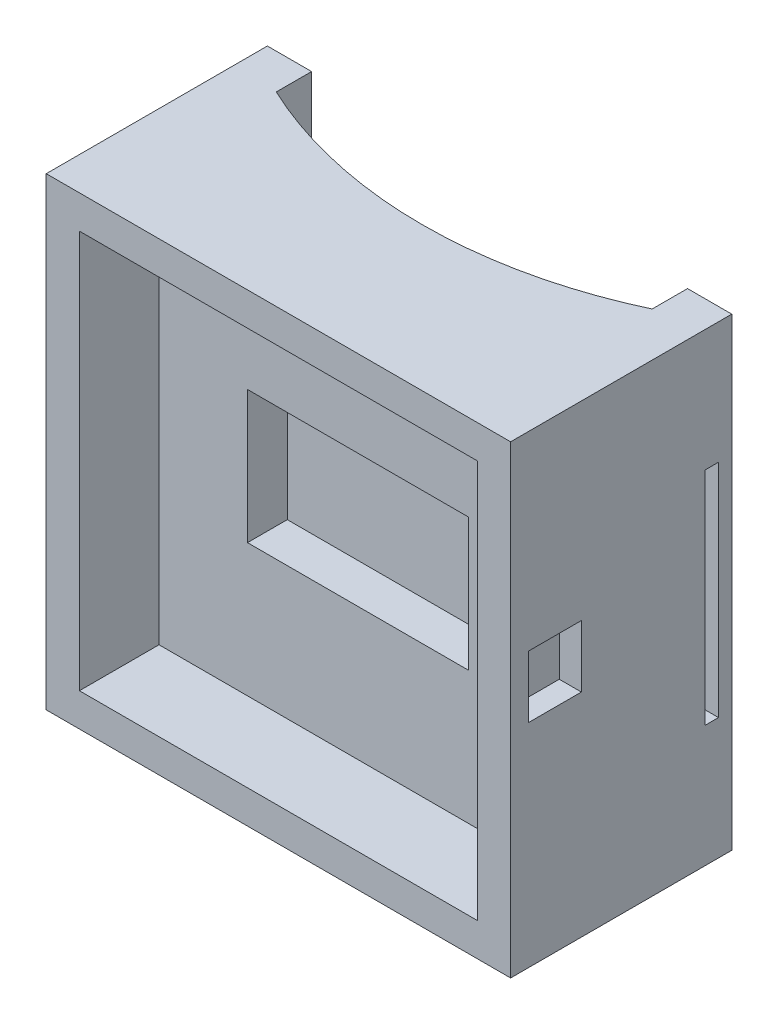
ISO-10303-21;
HEADER;
FILE_DESCRIPTION(('STEP AP214'),'2;1');
FILE_NAME('part.step','',(''),(''),'','','');
FILE_SCHEMA(('AUTOMOTIVE_DESIGN { 1 0 10303 214 1 1 1 1 }'));
ENDSEC;
DATA;
#1=APPLICATION_CONTEXT('core data for automotive mechanical design processes');
#2=APPLICATION_PROTOCOL_DEFINITION('international standard','automotive_design',2000,#1);
#3=PRODUCT_CONTEXT('',#1,'mechanical');
#4=PRODUCT('Part','Part','',(#3));
#5=PRODUCT_RELATED_PRODUCT_CATEGORY('part','',(#4));
#6=PRODUCT_DEFINITION_FORMATION('','',#4);
#7=PRODUCT_DEFINITION_CONTEXT('part definition',#1,'design');
#8=PRODUCT_DEFINITION('design','',#6,#7);
#9=PRODUCT_DEFINITION_SHAPE('','',#8);
#10=(LENGTH_UNIT() NAMED_UNIT(*) SI_UNIT(.MILLI.,.METRE.));
#11=(NAMED_UNIT(*) PLANE_ANGLE_UNIT() SI_UNIT($,.RADIAN.));
#12=(NAMED_UNIT(*) SI_UNIT($,.STERADIAN.) SOLID_ANGLE_UNIT());
#13=UNCERTAINTY_MEASURE_WITH_UNIT(LENGTH_MEASURE(1.E-05),#10,'distance_accuracy_value','');
#14=(GEOMETRIC_REPRESENTATION_CONTEXT(3) GLOBAL_UNCERTAINTY_ASSIGNED_CONTEXT((#13)) GLOBAL_UNIT_ASSIGNED_CONTEXT((#10,
#11,#12)) REPRESENTATION_CONTEXT('',''));
#15=CARTESIAN_POINT('',(0.,0.,0.));
#16=DIRECTION('',(0.,0.,1.));
#17=DIRECTION('',(1.,0.,0.));
#18=AXIS2_PLACEMENT_3D('',#15,#16,#17);
#19=CARTESIAN_POINT('',(0.,0.,0.));
#20=DIRECTION('',(0.,0.,-1.));
#21=DIRECTION('',(-1.,0.,0.));
#22=AXIS2_PLACEMENT_3D('',#19,#20,#21);
#23=PLANE('',#22);
#24=DIRECTION('',(0.,-1.,0.));
#25=VECTOR('',#24,1.);
#26=CARTESIAN_POINT('',(-42.5,52.5,0.));
#27=LINE('',#26,#25);
#28=CARTESIAN_POINT('',(-42.5,52.5,0.));
#29=VERTEX_POINT('',#28);
#30=CARTESIAN_POINT('',(-42.5,-52.5,0.));
#31=VERTEX_POINT('',#30);
#32=EDGE_CURVE('E387',#29,#31,#27,.T.);
#33=ORIENTED_EDGE('',*,*,#32,.T.);
#34=DIRECTION('',(1.,0.,0.));
#35=VECTOR('',#34,1.);
#36=CARTESIAN_POINT('',(-52.5,-52.5,0.));
#37=LINE('',#36,#35);
#38=CARTESIAN_POINT('',(-52.5,-52.5,0.));
#39=VERTEX_POINT('',#38);
#40=EDGE_CURVE('E415',#39,#31,#37,.T.);
#41=ORIENTED_EDGE('',*,*,#40,.F.);
#42=DIRECTION('',(0.,-1.,0.));
#43=VECTOR('',#42,1.);
#44=CARTESIAN_POINT('',(-52.5,52.5,0.));
#45=LINE('',#44,#43);
#46=CARTESIAN_POINT('',(-52.5,52.5,0.));
#47=VERTEX_POINT('',#46);
#48=EDGE_CURVE('E400',#47,#39,#45,.T.);
#49=ORIENTED_EDGE('',*,*,#48,.F.);
#50=DIRECTION('',(1.,0.,0.));
#51=VECTOR('',#50,1.);
#52=CARTESIAN_POINT('',(-52.5,52.5,0.));
#53=LINE('',#52,#51);
#54=EDGE_CURVE('E408',#47,#29,#53,.T.);
#55=ORIENTED_EDGE('',*,*,#54,.T.);
#56=EDGE_LOOP('',(#33,#41,#49,#55));
#57=FACE_BOUND('',#56,.T.);
#58=ADVANCED_FACE('F32',(#57),#23,.T.);
#59=CARTESIAN_POINT('',(-52.5,52.5,50.));
#60=DIRECTION('',(0.,1.,0.));
#61=DIRECTION('',(0.,0.,1.));
#62=AXIS2_PLACEMENT_3D('',#59,#60,#61);
#63=PLANE('',#62);
#64=DIRECTION('',(0.,0.,-1.));
#65=VECTOR('',#64,1.);
#66=CARTESIAN_POINT('',(-42.5,52.5,8.));
#67=LINE('',#66,#65);
#68=CARTESIAN_POINT('',(-42.5,52.5,8.));
#69=VERTEX_POINT('',#68);
#70=EDGE_CURVE('E377',#69,#29,#67,.T.);
#71=ORIENTED_EDGE('',*,*,#70,.T.);
#72=ORIENTED_EDGE('',*,*,#54,.F.);
#73=DIRECTION('',(0.,0.,-1.));
#74=VECTOR('',#73,1.);
#75=CARTESIAN_POINT('',(-52.5,52.5,50.));
#76=LINE('',#75,#74);
#77=CARTESIAN_POINT('',(-52.5,52.5,50.));
#78=VERTEX_POINT('',#77);
#79=EDGE_CURVE('E419',#78,#47,#76,.T.);
#80=ORIENTED_EDGE('',*,*,#79,.F.);
#81=DIRECTION('',(1.,0.,0.));
#82=VECTOR('',#81,1.);
#83=CARTESIAN_POINT('',(-52.5,52.5,50.));
#84=LINE('',#83,#82);
#85=CARTESIAN_POINT('',(52.5,52.5,50.));
#86=VERTEX_POINT('',#85);
#87=EDGE_CURVE('E396',#78,#86,#84,.T.);
#88=ORIENTED_EDGE('',*,*,#87,.T.);
#89=DIRECTION('',(0.,0.,-1.));
#90=VECTOR('',#89,1.);
#91=CARTESIAN_POINT('',(52.5,52.5,50.));
#92=LINE('',#91,#90);
#93=CARTESIAN_POINT('',(52.5,52.5,0.));
#94=VERTEX_POINT('',#93);
#95=EDGE_CURVE('E407',#86,#94,#92,.T.);
#96=ORIENTED_EDGE('',*,*,#95,.T.);
#97=CARTESIAN_POINT('',(42.5,52.5,0.));
#98=VERTEX_POINT('',#97);
#99=EDGE_CURVE('E390',#98,#94,#53,.T.);
#100=ORIENTED_EDGE('',*,*,#99,.F.);
#101=DIRECTION('',(0.,0.,1.));
#102=VECTOR('',#101,1.);
#103=CARTESIAN_POINT('',(42.5,52.5,0.));
#104=LINE('',#103,#102);
#105=CARTESIAN_POINT('',(42.5,52.5,8.00000000000001));
#106=VERTEX_POINT('',#105);
#107=EDGE_CURVE('E370',#98,#106,#104,.T.);
#108=ORIENTED_EDGE('',*,*,#107,.T.);
#109=CARTESIAN_POINT('',(0.,52.5,-82.5193349511584));
#110=DIRECTION('',(0.,-1.,0.));
#111=DIRECTION('',(0.,0.,1.));
#112=AXIS2_PLACEMENT_3D('',#109,#110,#111);
#113=CIRCLE('',#112,100.);
#114=EDGE_CURVE('E373',#106,#69,#113,.T.);
#115=ORIENTED_EDGE('',*,*,#114,.T.);
#116=EDGE_LOOP('',(#71,#72,#80,#88,#96,#100,#108,#115));
#117=FACE_BOUND('',#116,.T.);
#118=ADVANCED_FACE('F34',(#117),#63,.T.);
#119=CARTESIAN_POINT('',(-52.5,52.5,50.));
#120=DIRECTION('',(1.,0.,0.));
#121=DIRECTION('',(0.,1.,0.));
#122=AXIS2_PLACEMENT_3D('',#119,#120,#121);
#123=PLANE('',#122);
#124=DIRECTION('',(0.,0.,-1.));
#125=VECTOR('',#124,1.);
#126=CARTESIAN_POINT('',(-52.5,25.,3.));
#127=LINE('',#126,#125);
#128=CARTESIAN_POINT('',(-52.5,25.,6.));
#129=VERTEX_POINT('',#128);
#130=CARTESIAN_POINT('',(-52.5,25.,3.));
#131=VERTEX_POINT('',#130);
#132=EDGE_CURVE('E271',#129,#131,#127,.T.);
#133=ORIENTED_EDGE('',*,*,#132,.F.);
#134=DIRECTION('',(0.,1.,0.));
#135=VECTOR('',#134,1.);
#136=CARTESIAN_POINT('',(-52.5,25.,6.));
#137=LINE('',#136,#135);
#138=CARTESIAN_POINT('',(-52.5,-25.,6.));
#139=VERTEX_POINT('',#138);
#140=EDGE_CURVE('E55',#139,#129,#137,.T.);
#141=ORIENTED_EDGE('',*,*,#140,.F.);
#142=DIRECTION('',(0.,0.,1.));
#143=VECTOR('',#142,1.);
#144=CARTESIAN_POINT('',(-52.5,-25.,3.));
#145=LINE('',#144,#143);
#146=CARTESIAN_POINT('',(-52.5,-25.,3.));
#147=VERTEX_POINT('',#146);
#148=EDGE_CURVE('E260',#147,#139,#145,.T.);
#149=ORIENTED_EDGE('',*,*,#148,.F.);
#150=DIRECTION('',(0.,-1.,0.));
#151=VECTOR('',#150,1.);
#152=CARTESIAN_POINT('',(-52.5,25.,3.));
#153=LINE('',#152,#151);
#154=EDGE_CURVE('E274',#131,#147,#153,.T.);
#155=ORIENTED_EDGE('',*,*,#154,.F.);
#156=EDGE_LOOP('',(#133,#141,#149,#155));
#157=FACE_BOUND('',#156,.T.);
#158=ORIENTED_EDGE('',*,*,#48,.T.);
#159=DIRECTION('',(0.,0.,-1.));
#160=VECTOR('',#159,1.);
#161=CARTESIAN_POINT('',(-52.5,-52.5,50.));
#162=LINE('',#161,#160);
#163=CARTESIAN_POINT('',(-52.5,-52.5,50.));
#164=VERTEX_POINT('',#163);
#165=EDGE_CURVE('E422',#164,#39,#162,.T.);
#166=ORIENTED_EDGE('',*,*,#165,.F.);
#167=DIRECTION('',(0.,-1.,0.));
#168=VECTOR('',#167,1.);
#169=CARTESIAN_POINT('',(-52.5,52.5,50.));
#170=LINE('',#169,#168);
#171=EDGE_CURVE('E405',#78,#164,#170,.T.);
#172=ORIENTED_EDGE('',*,*,#171,.F.);
#173=ORIENTED_EDGE('',*,*,#79,.T.);
#174=EDGE_LOOP('',(#158,#166,#172,#173));
#175=FACE_BOUND('',#174,.T.);
#176=ADVANCED_FACE('F477',(#157,#175),#123,.F.);
#177=CARTESIAN_POINT('',(-52.5,-52.5,50.));
#178=DIRECTION('',(0.,1.,0.));
#179=DIRECTION('',(0.,0.,1.));
#180=AXIS2_PLACEMENT_3D('',#177,#178,#179);
#181=PLANE('',#180);
#182=ORIENTED_EDGE('',*,*,#40,.T.);
#183=DIRECTION('',(0.,0.,-1.));
#184=VECTOR('',#183,1.);
#185=CARTESIAN_POINT('',(-42.5,-52.5,8.));
#186=LINE('',#185,#184);
#187=CARTESIAN_POINT('',(-42.5,-52.5,8.));
#188=VERTEX_POINT('',#187);
#189=EDGE_CURVE('E374',#188,#31,#186,.T.);
#190=ORIENTED_EDGE('',*,*,#189,.F.);
#191=CARTESIAN_POINT('',(0.,-52.5,-82.5193349511584));
#192=DIRECTION('',(0.,-1.,0.));
#193=DIRECTION('',(0.,0.,1.));
#194=AXIS2_PLACEMENT_3D('',#191,#192,#193);
#195=CIRCLE('',#194,100.);
#196=CARTESIAN_POINT('',(42.5,-52.5,8.00000000000001));
#197=VERTEX_POINT('',#196);
#198=EDGE_CURVE('E383',#197,#188,#195,.T.);
#199=ORIENTED_EDGE('',*,*,#198,.F.);
#200=DIRECTION('',(0.,0.,1.));
#201=VECTOR('',#200,1.);
#202=CARTESIAN_POINT('',(42.5,-52.5,0.));
#203=LINE('',#202,#201);
#204=CARTESIAN_POINT('',(42.5,-52.5,0.));
#205=VERTEX_POINT('',#204);
#206=EDGE_CURVE('E363',#205,#197,#203,.T.);
#207=ORIENTED_EDGE('',*,*,#206,.F.);
#208=CARTESIAN_POINT('',(52.5,-52.5,0.));
#209=VERTEX_POINT('',#208);
#210=EDGE_CURVE('E414',#205,#209,#37,.T.);
#211=ORIENTED_EDGE('',*,*,#210,.T.);
#212=DIRECTION('',(0.,0.,-1.));
#213=VECTOR('',#212,1.);
#214=CARTESIAN_POINT('',(52.5,-52.5,50.));
#215=LINE('',#214,#213);
#216=CARTESIAN_POINT('',(52.5,-52.5,50.));
#217=VERTEX_POINT('',#216);
#218=EDGE_CURVE('E425',#217,#209,#215,.T.);
#219=ORIENTED_EDGE('',*,*,#218,.F.);
#220=DIRECTION('',(1.,0.,0.));
#221=VECTOR('',#220,1.);
#222=CARTESIAN_POINT('',(-52.5,-52.5,50.));
#223=LINE('',#222,#221);
#224=EDGE_CURVE('E403',#164,#217,#223,.T.);
#225=ORIENTED_EDGE('',*,*,#224,.F.);
#226=ORIENTED_EDGE('',*,*,#165,.T.);
#227=EDGE_LOOP('',(#182,#190,#199,#207,#211,#219,#225,#226));
#228=FACE_BOUND('',#227,.T.);
#229=ADVANCED_FACE('F503',(#228),#181,.F.);
#230=CARTESIAN_POINT('',(52.5,52.5,50.));
#231=DIRECTION('',(1.,0.,0.));
#232=DIRECTION('',(0.,1.,0.));
#233=AXIS2_PLACEMENT_3D('',#230,#231,#232);
#234=PLANE('',#233);
#235=DIRECTION('',(0.,1.,0.));
#236=VECTOR('',#235,1.);
#237=CARTESIAN_POINT('',(52.5,9.49549584084064,34.));
#238=LINE('',#237,#236);
#239=CARTESIAN_POINT('',(52.5,-4.50450415915936,34.));
#240=VERTEX_POINT('',#239);
#241=CARTESIAN_POINT('',(52.5,9.49549584084065,34.));
#242=VERTEX_POINT('',#241);
#243=EDGE_CURVE('E47',#240,#242,#238,.T.);
#244=ORIENTED_EDGE('',*,*,#243,.F.);
#245=DIRECTION('',(0.,0.,-1.));
#246=VECTOR('',#245,1.);
#247=CARTESIAN_POINT('',(52.5,-4.50450415915936,46.));
#248=LINE('',#247,#246);
#249=CARTESIAN_POINT('',(52.5,-4.50450415915936,46.));
#250=VERTEX_POINT('',#249);
#251=EDGE_CURVE('E238',#250,#240,#248,.T.);
#252=ORIENTED_EDGE('',*,*,#251,.F.);
#253=DIRECTION('',(0.,-1.,0.));
#254=VECTOR('',#253,1.);
#255=CARTESIAN_POINT('',(52.5,9.49549584084064,46.));
#256=LINE('',#255,#254);
#257=CARTESIAN_POINT('',(52.5,9.49549584084064,46.));
#258=VERTEX_POINT('',#257);
#259=EDGE_CURVE('E241',#258,#250,#256,.T.);
#260=ORIENTED_EDGE('',*,*,#259,.F.);
#261=DIRECTION('',(0.,0.,1.));
#262=VECTOR('',#261,1.);
#263=CARTESIAN_POINT('',(52.5,9.49549584084064,46.));
#264=LINE('',#263,#262);
#265=EDGE_CURVE('E247',#242,#258,#264,.T.);
#266=ORIENTED_EDGE('',*,*,#265,.F.);
#267=EDGE_LOOP('',(#244,#252,#260,#266));
#268=FACE_BOUND('',#267,.T.);
#269=DIRECTION('',(0.,1.,0.));
#270=VECTOR('',#269,1.);
#271=CARTESIAN_POINT('',(52.5,25.,6.));
#272=LINE('',#271,#270);
#273=CARTESIAN_POINT('',(52.5,-25.,6.));
#274=VERTEX_POINT('',#273);
#275=CARTESIAN_POINT('',(52.5,25.,6.));
#276=VERTEX_POINT('',#275);
#277=EDGE_CURVE('E256',#274,#276,#272,.T.);
#278=ORIENTED_EDGE('',*,*,#277,.T.);
#279=DIRECTION('',(0.,0.,-1.));
#280=VECTOR('',#279,1.);
#281=CARTESIAN_POINT('',(52.5,25.,3.));
#282=LINE('',#281,#280);
#283=CARTESIAN_POINT('',(52.5,25.,3.));
#284=VERTEX_POINT('',#283);
#285=EDGE_CURVE('E259',#276,#284,#282,.T.);
#286=ORIENTED_EDGE('',*,*,#285,.T.);
#287=DIRECTION('',(0.,-1.,0.));
#288=VECTOR('',#287,1.);
#289=CARTESIAN_POINT('',(52.5,25.,3.));
#290=LINE('',#289,#288);
#291=CARTESIAN_POINT('',(52.5,-25.,3.));
#292=VERTEX_POINT('',#291);
#293=EDGE_CURVE('E263',#284,#292,#290,.T.);
#294=ORIENTED_EDGE('',*,*,#293,.T.);
#295=DIRECTION('',(0.,0.,1.));
#296=VECTOR('',#295,1.);
#297=CARTESIAN_POINT('',(52.5,-25.,3.));
#298=LINE('',#297,#296);
#299=EDGE_CURVE('E266',#292,#274,#298,.T.);
#300=ORIENTED_EDGE('',*,*,#299,.T.);
#301=EDGE_LOOP('',(#278,#286,#294,#300));
#302=FACE_BOUND('',#301,.T.);
#303=DIRECTION('',(0.,-1.,0.));
#304=VECTOR('',#303,1.);
#305=CARTESIAN_POINT('',(52.5,52.5,0.));
#306=LINE('',#305,#304);
#307=EDGE_CURVE('E411',#94,#209,#306,.T.);
#308=ORIENTED_EDGE('',*,*,#307,.F.);
#309=ORIENTED_EDGE('',*,*,#95,.F.);
#310=DIRECTION('',(0.,-1.,0.));
#311=VECTOR('',#310,1.);
#312=CARTESIAN_POINT('',(52.5,52.5,50.));
#313=LINE('',#312,#311);
#314=EDGE_CURVE('E399',#86,#217,#313,.T.);
#315=ORIENTED_EDGE('',*,*,#314,.T.);
#316=ORIENTED_EDGE('',*,*,#218,.T.);
#317=EDGE_LOOP('',(#308,#309,#315,#316));
#318=FACE_BOUND('',#317,.T.);
#319=ADVANCED_FACE('F447',(#268,#302,#318),#234,.T.);
#320=CARTESIAN_POINT('',(0.,0.,50.));
#321=DIRECTION('',(0.,0.,-1.));
#322=DIRECTION('',(-1.,0.,0.));
#323=AXIS2_PLACEMENT_3D('',#320,#321,#322);
#324=PLANE('',#323);
#325=DIRECTION('',(-1.,0.,0.));
#326=VECTOR('',#325,1.);
#327=CARTESIAN_POINT('',(-45.,45.,50.));
#328=LINE('',#327,#326);
#329=CARTESIAN_POINT('',(45.,45.,50.));
#330=VERTEX_POINT('',#329);
#331=CARTESIAN_POINT('',(-45.,45.,50.));
#332=VERTEX_POINT('',#331);
#333=EDGE_CURVE('E353',#330,#332,#328,.T.);
#334=ORIENTED_EDGE('',*,*,#333,.F.);
#335=DIRECTION('',(0.,1.,0.));
#336=VECTOR('',#335,1.);
#337=CARTESIAN_POINT('',(45.,45.,50.));
#338=LINE('',#337,#336);
#339=CARTESIAN_POINT('',(45.,-45.,50.));
#340=VERTEX_POINT('',#339);
#341=EDGE_CURVE('E331',#340,#330,#338,.T.);
#342=ORIENTED_EDGE('',*,*,#341,.F.);
#343=DIRECTION('',(1.,0.,0.));
#344=VECTOR('',#343,1.);
#345=CARTESIAN_POINT('',(-45.,-45.,50.));
#346=LINE('',#345,#344);
#347=CARTESIAN_POINT('',(-45.,-45.,50.));
#348=VERTEX_POINT('',#347);
#349=EDGE_CURVE('E342',#348,#340,#346,.T.);
#350=ORIENTED_EDGE('',*,*,#349,.F.);
#351=DIRECTION('',(0.,-1.,0.));
#352=VECTOR('',#351,1.);
#353=CARTESIAN_POINT('',(-45.,45.,50.));
#354=LINE('',#353,#352);
#355=EDGE_CURVE('E356',#332,#348,#354,.T.);
#356=ORIENTED_EDGE('',*,*,#355,.F.);
#357=EDGE_LOOP('',(#334,#342,#350,#356));
#358=FACE_BOUND('',#357,.T.);
#359=ORIENTED_EDGE('',*,*,#87,.F.);
#360=ORIENTED_EDGE('',*,*,#171,.T.);
#361=ORIENTED_EDGE('',*,*,#224,.T.);
#362=ORIENTED_EDGE('',*,*,#314,.F.);
#363=EDGE_LOOP('',(#359,#360,#361,#362));
#364=FACE_BOUND('',#363,.T.);
#365=ADVANCED_FACE('F483',(#358,#364),#324,.F.);
#366=DIRECTION('',(0.,-1.,0.));
#367=VECTOR('',#366,1.);
#368=CARTESIAN_POINT('',(42.5,52.5,0.));
#369=LINE('',#368,#367);
#370=EDGE_CURVE('E380',#98,#205,#369,.T.);
#371=ORIENTED_EDGE('',*,*,#370,.F.);
#372=ORIENTED_EDGE('',*,*,#99,.T.);
#373=ORIENTED_EDGE('',*,*,#307,.T.);
#374=ORIENTED_EDGE('',*,*,#210,.F.);
#375=EDGE_LOOP('',(#371,#372,#373,#374));
#376=FACE_BOUND('',#375,.T.);
#377=ADVANCED_FACE('F473',(#376),#23,.T.);
#378=CARTESIAN_POINT('',(-42.5,52.5,8.));
#379=DIRECTION('',(-1.,0.,0.));
#380=DIRECTION('',(0.,0.,1.));
#381=AXIS2_PLACEMENT_3D('',#378,#379,#380);
#382=PLANE('',#381);
#383=DIRECTION('',(0.,0.,1.));
#384=VECTOR('',#383,1.);
#385=CARTESIAN_POINT('',(-42.5,-25.,8.));
#386=LINE('',#385,#384);
#387=CARTESIAN_POINT('',(-42.5,-25.,3.));
#388=VERTEX_POINT('',#387);
#389=CARTESIAN_POINT('',(-42.5,-25.,6.));
#390=VERTEX_POINT('',#389);
#391=EDGE_CURVE('E299',#388,#390,#386,.T.);
#392=ORIENTED_EDGE('',*,*,#391,.T.);
#393=DIRECTION('',(0.,1.,0.));
#394=VECTOR('',#393,1.);
#395=CARTESIAN_POINT('',(-42.5,52.5,5.99999999999999));
#396=LINE('',#395,#394);
#397=CARTESIAN_POINT('',(-42.5,25.,6.));
#398=VERTEX_POINT('',#397);
#399=EDGE_CURVE('E302',#390,#398,#396,.T.);
#400=ORIENTED_EDGE('',*,*,#399,.T.);
#401=DIRECTION('',(0.,0.,-1.));
#402=VECTOR('',#401,1.);
#403=CARTESIAN_POINT('',(-42.5,25.,8.));
#404=LINE('',#403,#402);
#405=CARTESIAN_POINT('',(-42.5,25.,3.));
#406=VERTEX_POINT('',#405);
#407=EDGE_CURVE('E282',#398,#406,#404,.T.);
#408=ORIENTED_EDGE('',*,*,#407,.T.);
#409=DIRECTION('',(0.,-1.,0.));
#410=VECTOR('',#409,1.);
#411=CARTESIAN_POINT('',(-42.5,52.5,2.99999999999999));
#412=LINE('',#411,#410);
#413=EDGE_CURVE('E296',#406,#388,#412,.T.);
#414=ORIENTED_EDGE('',*,*,#413,.T.);
#415=EDGE_LOOP('',(#392,#400,#408,#414));
#416=FACE_BOUND('',#415,.T.);
#417=ORIENTED_EDGE('',*,*,#189,.T.);
#418=ORIENTED_EDGE('',*,*,#32,.F.);
#419=ORIENTED_EDGE('',*,*,#70,.F.);
#420=DIRECTION('',(0.,-1.,0.));
#421=VECTOR('',#420,1.);
#422=CARTESIAN_POINT('',(-42.5,52.5,8.));
#423=LINE('',#422,#421);
#424=EDGE_CURVE('E391',#69,#188,#423,.T.);
#425=ORIENTED_EDGE('',*,*,#424,.T.);
#426=EDGE_LOOP('',(#417,#418,#419,#425));
#427=FACE_BOUND('',#426,.T.);
#428=ADVANCED_FACE('F482',(#416,#427),#382,.F.);
#429=CARTESIAN_POINT('',(0.,52.5,-82.5193349511584));
#430=DIRECTION('',(0.,-1.,0.));
#431=DIRECTION('',(0.,0.,-1.));
#432=AXIS2_PLACEMENT_3D('',#429,#430,#431);
#433=CYLINDRICAL_SURFACE('',#432,100.);
#434=ORIENTED_EDGE('',*,*,#198,.T.);
#435=ORIENTED_EDGE('',*,*,#424,.F.);
#436=ORIENTED_EDGE('',*,*,#114,.F.);
#437=DIRECTION('',(0.,-1.,0.));
#438=VECTOR('',#437,1.);
#439=CARTESIAN_POINT('',(42.5,52.5,8.00000000000001));
#440=LINE('',#439,#438);
#441=EDGE_CURVE('E393',#106,#197,#440,.T.);
#442=ORIENTED_EDGE('',*,*,#441,.T.);
#443=EDGE_LOOP('',(#434,#435,#436,#442));
#444=FACE_BOUND('',#443,.T.);
#445=ADVANCED_FACE('F489',(#444),#433,.F.);
#446=CARTESIAN_POINT('',(42.5,52.5,0.));
#447=DIRECTION('',(1.,0.,0.));
#448=DIRECTION('',(0.,0.,-1.));
#449=AXIS2_PLACEMENT_3D('',#446,#447,#448);
#450=PLANE('',#449);
#451=DIRECTION('',(0.,0.,1.));
#452=VECTOR('',#451,1.);
#453=CARTESIAN_POINT('',(42.5,25.,0.));
#454=LINE('',#453,#452);
#455=CARTESIAN_POINT('',(42.5,25.,3.));
#456=VERTEX_POINT('',#455);
#457=CARTESIAN_POINT('',(42.5,25.,6.));
#458=VERTEX_POINT('',#457);
#459=EDGE_CURVE('E421',#456,#458,#454,.T.);
#460=ORIENTED_EDGE('',*,*,#459,.T.);
#461=DIRECTION('',(0.,-1.,0.));
#462=VECTOR('',#461,1.);
#463=CARTESIAN_POINT('',(42.5,52.5,5.99999999999999));
#464=LINE('',#463,#462);
#465=CARTESIAN_POINT('',(42.5,-25.,6.));
#466=VERTEX_POINT('',#465);
#467=EDGE_CURVE('E11',#458,#466,#464,.T.);
#468=ORIENTED_EDGE('',*,*,#467,.T.);
#469=DIRECTION('',(0.,0.,-1.));
#470=VECTOR('',#469,1.);
#471=CARTESIAN_POINT('',(42.5,-25.,0.));
#472=LINE('',#471,#470);
#473=CARTESIAN_POINT('',(42.5,-25.,3.));
#474=VERTEX_POINT('',#473);
#475=EDGE_CURVE('E40',#466,#474,#472,.T.);
#476=ORIENTED_EDGE('',*,*,#475,.T.);
#477=DIRECTION('',(0.,1.,0.));
#478=VECTOR('',#477,1.);
#479=CARTESIAN_POINT('',(42.5,52.5,2.99999999999999));
#480=LINE('',#479,#478);
#481=EDGE_CURVE('E432',#474,#456,#480,.T.);
#482=ORIENTED_EDGE('',*,*,#481,.T.);
#483=EDGE_LOOP('',(#460,#468,#476,#482));
#484=FACE_BOUND('',#483,.T.);
#485=ORIENTED_EDGE('',*,*,#206,.T.);
#486=ORIENTED_EDGE('',*,*,#441,.F.);
#487=ORIENTED_EDGE('',*,*,#107,.F.);
#488=ORIENTED_EDGE('',*,*,#370,.T.);
#489=EDGE_LOOP('',(#485,#486,#487,#488));
#490=FACE_BOUND('',#489,.T.);
#491=ADVANCED_FACE('F436',(#484,#490),#450,.F.);
#492=CARTESIAN_POINT('',(45.,45.,32.));
#493=DIRECTION('',(1.,0.,0.));
#494=DIRECTION('',(0.,1.,0.));
#495=AXIS2_PLACEMENT_3D('',#492,#493,#494);
#496=PLANE('',#495);
#497=ORIENTED_EDGE('',*,*,#341,.T.);
#498=DIRECTION('',(0.,0.,1.));
#499=VECTOR('',#498,1.);
#500=CARTESIAN_POINT('',(45.,45.,32.));
#501=LINE('',#500,#499);
#502=CARTESIAN_POINT('',(45.,45.,32.));
#503=VERTEX_POINT('',#502);
#504=EDGE_CURVE('E351',#503,#330,#501,.T.);
#505=ORIENTED_EDGE('',*,*,#504,.F.);
#506=DIRECTION('',(0.,1.,0.));
#507=VECTOR('',#506,1.);
#508=CARTESIAN_POINT('',(45.,45.,32.));
#509=LINE('',#508,#507);
#510=CARTESIAN_POINT('',(45.,-45.,32.));
#511=VERTEX_POINT('',#510);
#512=EDGE_CURVE('E338',#511,#503,#509,.T.);
#513=ORIENTED_EDGE('',*,*,#512,.F.);
#514=DIRECTION('',(0.,0.,1.));
#515=VECTOR('',#514,1.);
#516=CARTESIAN_POINT('',(45.,-45.,32.));
#517=LINE('',#516,#515);
#518=EDGE_CURVE('E361',#511,#340,#517,.T.);
#519=ORIENTED_EDGE('',*,*,#518,.T.);
#520=EDGE_LOOP('',(#497,#505,#513,#519));
#521=FACE_BOUND('',#520,.T.);
#522=ADVANCED_FACE('F588',(#521),#496,.F.);
#523=CARTESIAN_POINT('',(-45.,-45.,32.));
#524=DIRECTION('',(0.,-1.,0.));
#525=DIRECTION('',(0.,0.,-1.));
#526=AXIS2_PLACEMENT_3D('',#523,#524,#525);
#527=PLANE('',#526);
#528=ORIENTED_EDGE('',*,*,#349,.T.);
#529=ORIENTED_EDGE('',*,*,#518,.F.);
#530=DIRECTION('',(1.,0.,0.));
#531=VECTOR('',#530,1.);
#532=CARTESIAN_POINT('',(-45.,-45.,32.));
#533=LINE('',#532,#531);
#534=CARTESIAN_POINT('',(-45.,-45.,32.));
#535=VERTEX_POINT('',#534);
#536=EDGE_CURVE('E348',#535,#511,#533,.T.);
#537=ORIENTED_EDGE('',*,*,#536,.F.);
#538=DIRECTION('',(0.,0.,1.));
#539=VECTOR('',#538,1.);
#540=CARTESIAN_POINT('',(-45.,-45.,32.));
#541=LINE('',#540,#539);
#542=EDGE_CURVE('E364',#535,#348,#541,.T.);
#543=ORIENTED_EDGE('',*,*,#542,.T.);
#544=EDGE_LOOP('',(#528,#529,#537,#543));
#545=FACE_BOUND('',#544,.T.);
#546=ADVANCED_FACE('F584',(#545),#527,.F.);
#547=CARTESIAN_POINT('',(-45.,45.,32.));
#548=DIRECTION('',(-1.,0.,0.));
#549=DIRECTION('',(0.,-1.,0.));
#550=AXIS2_PLACEMENT_3D('',#547,#548,#549);
#551=PLANE('',#550);
#552=ORIENTED_EDGE('',*,*,#355,.T.);
#553=ORIENTED_EDGE('',*,*,#542,.F.);
#554=DIRECTION('',(0.,-1.,0.));
#555=VECTOR('',#554,1.);
#556=CARTESIAN_POINT('',(-45.,45.,32.));
#557=LINE('',#556,#555);
#558=CARTESIAN_POINT('',(-45.,45.,32.));
#559=VERTEX_POINT('',#558);
#560=EDGE_CURVE('E345',#559,#535,#557,.T.);
#561=ORIENTED_EDGE('',*,*,#560,.F.);
#562=DIRECTION('',(0.,0.,1.));
#563=VECTOR('',#562,1.);
#564=CARTESIAN_POINT('',(-45.,45.,32.));
#565=LINE('',#564,#563);
#566=EDGE_CURVE('E366',#559,#332,#565,.T.);
#567=ORIENTED_EDGE('',*,*,#566,.T.);
#568=EDGE_LOOP('',(#552,#553,#561,#567));
#569=FACE_BOUND('',#568,.T.);
#570=ADVANCED_FACE('F587',(#569),#551,.F.);
#571=CARTESIAN_POINT('',(-45.,45.,32.));
#572=DIRECTION('',(0.,1.,0.));
#573=DIRECTION('',(0.,0.,1.));
#574=AXIS2_PLACEMENT_3D('',#571,#572,#573);
#575=PLANE('',#574);
#576=ORIENTED_EDGE('',*,*,#333,.T.);
#577=ORIENTED_EDGE('',*,*,#566,.F.);
#578=DIRECTION('',(-1.,0.,0.));
#579=VECTOR('',#578,1.);
#580=CARTESIAN_POINT('',(-45.,45.,32.));
#581=LINE('',#580,#579);
#582=EDGE_CURVE('E341',#503,#559,#581,.T.);
#583=ORIENTED_EDGE('',*,*,#582,.F.);
#584=ORIENTED_EDGE('',*,*,#504,.T.);
#585=EDGE_LOOP('',(#576,#577,#583,#584));
#586=FACE_BOUND('',#585,.T.);
#587=ADVANCED_FACE('F582',(#586),#575,.F.);
#588=CARTESIAN_POINT('',(0.,0.,32.));
#589=DIRECTION('',(0.,0.,1.));
#590=DIRECTION('',(1.,0.,0.));
#591=AXIS2_PLACEMENT_3D('',#588,#589,#590);
#592=PLANE('',#591);
#593=DIRECTION('',(0.,-1.,0.));
#594=VECTOR('',#593,1.);
#595=CARTESIAN_POINT('',(-25.,-15.,32.));
#596=LINE('',#595,#594);
#597=CARTESIAN_POINT('',(-25.,15.,32.));
#598=VERTEX_POINT('',#597);
#599=CARTESIAN_POINT('',(-25.,-15.,32.));
#600=VERTEX_POINT('',#599);
#601=EDGE_CURVE('E305',#598,#600,#596,.T.);
#602=ORIENTED_EDGE('',*,*,#601,.F.);
#603=DIRECTION('',(-1.,0.,0.));
#604=VECTOR('',#603,1.);
#605=CARTESIAN_POINT('',(25.,15.,32.));
#606=LINE('',#605,#604);
#607=CARTESIAN_POINT('',(25.,15.,32.));
#608=VERTEX_POINT('',#607);
#609=EDGE_CURVE('E310',#608,#598,#606,.T.);
#610=ORIENTED_EDGE('',*,*,#609,.F.);
#611=DIRECTION('',(0.,1.,0.));
#612=VECTOR('',#611,1.);
#613=CARTESIAN_POINT('',(25.,-15.,32.));
#614=LINE('',#613,#612);
#615=CARTESIAN_POINT('',(25.,-15.,32.));
#616=VERTEX_POINT('',#615);
#617=EDGE_CURVE('E325',#616,#608,#614,.T.);
#618=ORIENTED_EDGE('',*,*,#617,.F.);
#619=DIRECTION('',(1.,0.,0.));
#620=VECTOR('',#619,1.);
#621=CARTESIAN_POINT('',(25.,-15.,32.));
#622=LINE('',#621,#620);
#623=EDGE_CURVE('E322',#600,#616,#622,.T.);
#624=ORIENTED_EDGE('',*,*,#623,.F.);
#625=EDGE_LOOP('',(#602,#610,#618,#624));
#626=FACE_BOUND('',#625,.T.);
#627=ORIENTED_EDGE('',*,*,#512,.T.);
#628=ORIENTED_EDGE('',*,*,#582,.T.);
#629=ORIENTED_EDGE('',*,*,#560,.T.);
#630=ORIENTED_EDGE('',*,*,#536,.T.);
#631=EDGE_LOOP('',(#627,#628,#629,#630));
#632=FACE_BOUND('',#631,.T.);
#633=ADVANCED_FACE('F578',(#626,#632),#592,.T.);
#634=CARTESIAN_POINT('',(-25.,-15.,23.));
#635=DIRECTION('',(-1.,0.,0.));
#636=DIRECTION('',(0.,0.,1.));
#637=AXIS2_PLACEMENT_3D('',#634,#635,#636);
#638=PLANE('',#637);
#639=ORIENTED_EDGE('',*,*,#601,.T.);
#640=DIRECTION('',(0.,0.,1.));
#641=VECTOR('',#640,1.);
#642=CARTESIAN_POINT('',(-25.,-15.,23.));
#643=LINE('',#642,#641);
#644=CARTESIAN_POINT('',(-25.,-15.,23.));
#645=VERTEX_POINT('',#644);
#646=EDGE_CURVE('E319',#645,#600,#643,.T.);
#647=ORIENTED_EDGE('',*,*,#646,.F.);
#648=DIRECTION('',(0.,-1.,0.));
#649=VECTOR('',#648,1.);
#650=CARTESIAN_POINT('',(-25.,-15.,23.));
#651=LINE('',#650,#649);
#652=CARTESIAN_POINT('',(-25.,15.,23.));
#653=VERTEX_POINT('',#652);
#654=EDGE_CURVE('E306',#653,#645,#651,.T.);
#655=ORIENTED_EDGE('',*,*,#654,.F.);
#656=DIRECTION('',(0.,0.,1.));
#657=VECTOR('',#656,1.);
#658=CARTESIAN_POINT('',(-25.,15.,23.));
#659=LINE('',#658,#657);
#660=EDGE_CURVE('E329',#653,#598,#659,.T.);
#661=ORIENTED_EDGE('',*,*,#660,.T.);
#662=EDGE_LOOP('',(#639,#647,#655,#661));
#663=FACE_BOUND('',#662,.T.);
#664=ADVANCED_FACE('F568',(#663),#638,.F.);
#665=CARTESIAN_POINT('',(25.,15.,23.));
#666=DIRECTION('',(0.,1.,0.));
#667=DIRECTION('',(-1.,0.,0.));
#668=AXIS2_PLACEMENT_3D('',#665,#666,#667);
#669=PLANE('',#668);
#670=ORIENTED_EDGE('',*,*,#609,.T.);
#671=ORIENTED_EDGE('',*,*,#660,.F.);
#672=DIRECTION('',(-1.,0.,0.));
#673=VECTOR('',#672,1.);
#674=CARTESIAN_POINT('',(25.,15.,23.));
#675=LINE('',#674,#673);
#676=CARTESIAN_POINT('',(25.,15.,23.));
#677=VERTEX_POINT('',#676);
#678=EDGE_CURVE('E316',#677,#653,#675,.T.);
#679=ORIENTED_EDGE('',*,*,#678,.F.);
#680=DIRECTION('',(0.,0.,1.));
#681=VECTOR('',#680,1.);
#682=CARTESIAN_POINT('',(25.,15.,23.));
#683=LINE('',#682,#681);
#684=EDGE_CURVE('E332',#677,#608,#683,.T.);
#685=ORIENTED_EDGE('',*,*,#684,.T.);
#686=EDGE_LOOP('',(#670,#671,#679,#685));
#687=FACE_BOUND('',#686,.T.);
#688=ADVANCED_FACE('F564',(#687),#669,.F.);
#689=CARTESIAN_POINT('',(25.,-15.,23.));
#690=DIRECTION('',(1.,0.,0.));
#691=DIRECTION('',(0.,0.,-1.));
#692=AXIS2_PLACEMENT_3D('',#689,#690,#691);
#693=PLANE('',#692);
#694=ORIENTED_EDGE('',*,*,#617,.T.);
#695=ORIENTED_EDGE('',*,*,#684,.F.);
#696=DIRECTION('',(0.,1.,0.));
#697=VECTOR('',#696,1.);
#698=CARTESIAN_POINT('',(25.,-15.,23.));
#699=LINE('',#698,#697);
#700=CARTESIAN_POINT('',(25.,-15.,23.));
#701=VERTEX_POINT('',#700);
#702=EDGE_CURVE('E313',#701,#677,#699,.T.);
#703=ORIENTED_EDGE('',*,*,#702,.F.);
#704=DIRECTION('',(0.,0.,1.));
#705=VECTOR('',#704,1.);
#706=CARTESIAN_POINT('',(25.,-15.,23.));
#707=LINE('',#706,#705);
#708=EDGE_CURVE('E335',#701,#616,#707,.T.);
#709=ORIENTED_EDGE('',*,*,#708,.T.);
#710=EDGE_LOOP('',(#694,#695,#703,#709));
#711=FACE_BOUND('',#710,.T.);
#712=ADVANCED_FACE('F567',(#711),#693,.F.);
#713=CARTESIAN_POINT('',(25.,-15.,23.));
#714=DIRECTION('',(0.,-1.,0.));
#715=DIRECTION('',(1.,0.,0.));
#716=AXIS2_PLACEMENT_3D('',#713,#714,#715);
#717=PLANE('',#716);
#718=ORIENTED_EDGE('',*,*,#623,.T.);
#719=ORIENTED_EDGE('',*,*,#708,.F.);
#720=DIRECTION('',(1.,0.,0.));
#721=VECTOR('',#720,1.);
#722=CARTESIAN_POINT('',(25.,-15.,23.));
#723=LINE('',#722,#721);
#724=EDGE_CURVE('E309',#645,#701,#723,.T.);
#725=ORIENTED_EDGE('',*,*,#724,.F.);
#726=ORIENTED_EDGE('',*,*,#646,.T.);
#727=EDGE_LOOP('',(#718,#719,#725,#726));
#728=FACE_BOUND('',#727,.T.);
#729=ADVANCED_FACE('F464',(#728),#717,.F.);
#730=CARTESIAN_POINT('',(0.,0.,23.));
#731=DIRECTION('',(0.,0.,1.));
#732=DIRECTION('',(1.,0.,0.));
#733=AXIS2_PLACEMENT_3D('',#730,#731,#732);
#734=PLANE('',#733);
#735=ORIENTED_EDGE('',*,*,#654,.T.);
#736=ORIENTED_EDGE('',*,*,#724,.T.);
#737=ORIENTED_EDGE('',*,*,#702,.T.);
#738=ORIENTED_EDGE('',*,*,#678,.T.);
#739=EDGE_LOOP('',(#735,#736,#737,#738));
#740=FACE_BOUND('',#739,.T.);
#741=ADVANCED_FACE('F455',(#740),#734,.T.);
#742=CARTESIAN_POINT('',(52.5,25.,3.));
#743=DIRECTION('',(0.,1.,0.));
#744=DIRECTION('',(-1.,0.,0.));
#745=AXIS2_PLACEMENT_3D('',#742,#743,#744);
#746=PLANE('',#745);
#747=DIRECTION('',(-1.,0.,0.));
#748=VECTOR('',#747,1.);
#749=CARTESIAN_POINT('',(52.5,25.,3.));
#750=LINE('',#749,#748);
#751=EDGE_CURVE('E288',#284,#456,#750,.T.);
#752=ORIENTED_EDGE('',*,*,#751,.F.);
#753=ORIENTED_EDGE('',*,*,#285,.F.);
#754=DIRECTION('',(-1.,0.,0.));
#755=VECTOR('',#754,1.);
#756=CARTESIAN_POINT('',(52.5,25.,6.));
#757=LINE('',#756,#755);
#758=EDGE_CURVE('E292',#276,#458,#757,.T.);
#759=ORIENTED_EDGE('',*,*,#758,.T.);
#760=ORIENTED_EDGE('',*,*,#459,.F.);
#761=EDGE_LOOP('',(#752,#753,#759,#760));
#762=FACE_BOUND('',#761,.T.);
#763=ADVANCED_FACE('F453',(#762),#746,.F.);
#764=CARTESIAN_POINT('',(52.5,25.,3.));
#765=DIRECTION('',(0.,0.,-1.));
#766=DIRECTION('',(0.,1.,0.));
#767=AXIS2_PLACEMENT_3D('',#764,#765,#766);
#768=PLANE('',#767);
#769=DIRECTION('',(-1.,0.,0.));
#770=VECTOR('',#769,1.);
#771=CARTESIAN_POINT('',(52.5,-25.,3.));
#772=LINE('',#771,#770);
#773=EDGE_CURVE('E284',#292,#474,#772,.T.);
#774=ORIENTED_EDGE('',*,*,#773,.F.);
#775=ORIENTED_EDGE('',*,*,#293,.F.);
#776=ORIENTED_EDGE('',*,*,#751,.T.);
#777=ORIENTED_EDGE('',*,*,#481,.F.);
#778=EDGE_LOOP('',(#774,#775,#776,#777));
#779=FACE_BOUND('',#778,.T.);
#780=ADVANCED_FACE('F451',(#779),#768,.F.);
#781=CARTESIAN_POINT('',(52.5,-25.,3.));
#782=DIRECTION('',(0.,-1.,0.));
#783=DIRECTION('',(1.,0.,0.));
#784=AXIS2_PLACEMENT_3D('',#781,#782,#783);
#785=PLANE('',#784);
#786=DIRECTION('',(-1.,0.,0.));
#787=VECTOR('',#786,1.);
#788=CARTESIAN_POINT('',(52.5,-25.,6.));
#789=LINE('',#788,#787);
#790=EDGE_CURVE('E279',#274,#466,#789,.T.);
#791=ORIENTED_EDGE('',*,*,#790,.F.);
#792=ORIENTED_EDGE('',*,*,#299,.F.);
#793=ORIENTED_EDGE('',*,*,#773,.T.);
#794=ORIENTED_EDGE('',*,*,#475,.F.);
#795=EDGE_LOOP('',(#791,#792,#793,#794));
#796=FACE_BOUND('',#795,.T.);
#797=ADVANCED_FACE('F440',(#796),#785,.F.);
#798=CARTESIAN_POINT('',(52.5,25.,6.));
#799=DIRECTION('',(0.,0.,1.));
#800=DIRECTION('',(0.,-1.,0.));
#801=AXIS2_PLACEMENT_3D('',#798,#799,#800);
#802=PLANE('',#801);
#803=ORIENTED_EDGE('',*,*,#758,.F.);
#804=ORIENTED_EDGE('',*,*,#277,.F.);
#805=ORIENTED_EDGE('',*,*,#790,.T.);
#806=ORIENTED_EDGE('',*,*,#467,.F.);
#807=EDGE_LOOP('',(#803,#804,#805,#806));
#808=FACE_BOUND('',#807,.T.);
#809=ADVANCED_FACE('F444',(#808),#802,.F.);
#810=EDGE_CURVE('E283',#390,#139,#789,.T.);
#811=ORIENTED_EDGE('',*,*,#810,.T.);
#812=ORIENTED_EDGE('',*,*,#140,.T.);
#813=EDGE_CURVE('E269',#398,#129,#757,.T.);
#814=ORIENTED_EDGE('',*,*,#813,.F.);
#815=ORIENTED_EDGE('',*,*,#399,.F.);
#816=EDGE_LOOP('',(#811,#812,#814,#815));
#817=FACE_BOUND('',#816,.T.);
#818=ADVANCED_FACE('F548',(#817),#802,.F.);
#819=EDGE_CURVE('E287',#388,#147,#772,.T.);
#820=ORIENTED_EDGE('',*,*,#819,.T.);
#821=ORIENTED_EDGE('',*,*,#148,.T.);
#822=ORIENTED_EDGE('',*,*,#810,.F.);
#823=ORIENTED_EDGE('',*,*,#391,.F.);
#824=EDGE_LOOP('',(#820,#821,#822,#823));
#825=FACE_BOUND('',#824,.T.);
#826=ADVANCED_FACE('F546',(#825),#785,.F.);
#827=EDGE_CURVE('E291',#406,#131,#750,.T.);
#828=ORIENTED_EDGE('',*,*,#827,.T.);
#829=ORIENTED_EDGE('',*,*,#154,.T.);
#830=ORIENTED_EDGE('',*,*,#819,.F.);
#831=ORIENTED_EDGE('',*,*,#413,.F.);
#832=EDGE_LOOP('',(#828,#829,#830,#831));
#833=FACE_BOUND('',#832,.T.);
#834=ADVANCED_FACE('F463',(#833),#768,.F.);
#835=ORIENTED_EDGE('',*,*,#813,.T.);
#836=ORIENTED_EDGE('',*,*,#132,.T.);
#837=ORIENTED_EDGE('',*,*,#827,.F.);
#838=ORIENTED_EDGE('',*,*,#407,.F.);
#839=EDGE_LOOP('',(#835,#836,#837,#838));
#840=FACE_BOUND('',#839,.T.);
#841=ADVANCED_FACE('F457',(#840),#746,.F.);
#842=CARTESIAN_POINT('',(47.5,9.49549584084064,34.));
#843=DIRECTION('',(0.,0.,-1.));
#844=DIRECTION('',(-1.,0.,0.));
#845=AXIS2_PLACEMENT_3D('',#842,#843,#844);
#846=PLANE('',#845);
#847=ORIENTED_EDGE('',*,*,#243,.T.);
#848=DIRECTION('',(1.,0.,0.));
#849=VECTOR('',#848,1.);
#850=CARTESIAN_POINT('',(47.5,9.49549584084064,34.));
#851=LINE('',#850,#849);
#852=CARTESIAN_POINT('',(47.5,9.49549584084064,34.));
#853=VERTEX_POINT('',#852);
#854=EDGE_CURVE('E216',#853,#242,#851,.T.);
#855=ORIENTED_EDGE('',*,*,#854,.F.);
#856=DIRECTION('',(0.,1.,0.));
#857=VECTOR('',#856,1.);
#858=CARTESIAN_POINT('',(47.5,9.49549584084064,34.));
#859=LINE('',#858,#857);
#860=CARTESIAN_POINT('',(47.5,-4.50450415915936,34.));
#861=VERTEX_POINT('',#860);
#862=EDGE_CURVE('E220',#861,#853,#859,.T.);
#863=ORIENTED_EDGE('',*,*,#862,.F.);
#864=DIRECTION('',(1.,0.,0.));
#865=VECTOR('',#864,1.);
#866=CARTESIAN_POINT('',(47.5,-4.50450415915936,34.));
#867=LINE('',#866,#865);
#868=EDGE_CURVE('E251',#861,#240,#867,.T.);
#869=ORIENTED_EDGE('',*,*,#868,.T.);
#870=EDGE_LOOP('',(#847,#855,#863,#869));
#871=FACE_BOUND('',#870,.T.);
#872=ADVANCED_FACE('F218',(#871),#846,.F.);
#873=CARTESIAN_POINT('',(47.5,-4.50450415915936,46.));
#874=DIRECTION('',(0.,-1.,0.));
#875=DIRECTION('',(1.,0.,0.));
#876=AXIS2_PLACEMENT_3D('',#873,#874,#875);
#877=PLANE('',#876);
#878=ORIENTED_EDGE('',*,*,#251,.T.);
#879=ORIENTED_EDGE('',*,*,#868,.F.);
#880=DIRECTION('',(0.,0.,-1.));
#881=VECTOR('',#880,1.);
#882=CARTESIAN_POINT('',(47.5,-4.50450415915936,46.));
#883=LINE('',#882,#881);
#884=CARTESIAN_POINT('',(47.5,-4.50450415915936,46.));
#885=VERTEX_POINT('',#884);
#886=EDGE_CURVE('E226',#885,#861,#883,.T.);
#887=ORIENTED_EDGE('',*,*,#886,.F.);
#888=DIRECTION('',(1.,0.,0.));
#889=VECTOR('',#888,1.);
#890=CARTESIAN_POINT('',(47.5,-4.50450415915936,46.));
#891=LINE('',#890,#889);
#892=EDGE_CURVE('E253',#885,#250,#891,.T.);
#893=ORIENTED_EDGE('',*,*,#892,.T.);
#894=EDGE_LOOP('',(#878,#879,#887,#893));
#895=FACE_BOUND('',#894,.T.);
#896=ADVANCED_FACE('F533',(#895),#877,.F.);
#897=CARTESIAN_POINT('',(47.5,9.49549584084064,46.));
#898=DIRECTION('',(0.,0.,1.));
#899=DIRECTION('',(1.,0.,0.));
#900=AXIS2_PLACEMENT_3D('',#897,#898,#899);
#901=PLANE('',#900);
#902=ORIENTED_EDGE('',*,*,#259,.T.);
#903=ORIENTED_EDGE('',*,*,#892,.F.);
#904=DIRECTION('',(0.,-1.,0.));
#905=VECTOR('',#904,1.);
#906=CARTESIAN_POINT('',(47.5,9.49549584084064,46.));
#907=LINE('',#906,#905);
#908=CARTESIAN_POINT('',(47.5,9.49549584084064,46.));
#909=VERTEX_POINT('',#908);
#910=EDGE_CURVE('E234',#909,#885,#907,.T.);
#911=ORIENTED_EDGE('',*,*,#910,.F.);
#912=DIRECTION('',(1.,0.,0.));
#913=VECTOR('',#912,1.);
#914=CARTESIAN_POINT('',(47.5,9.49549584084064,46.));
#915=LINE('',#914,#913);
#916=EDGE_CURVE('E225',#909,#258,#915,.T.);
#917=ORIENTED_EDGE('',*,*,#916,.T.);
#918=EDGE_LOOP('',(#902,#903,#911,#917));
#919=FACE_BOUND('',#918,.T.);
#920=ADVANCED_FACE('F531',(#919),#901,.F.);
#921=CARTESIAN_POINT('',(47.5,9.49549584084064,46.));
#922=DIRECTION('',(0.,1.,0.));
#923=DIRECTION('',(-1.,0.,0.));
#924=AXIS2_PLACEMENT_3D('',#921,#922,#923);
#925=PLANE('',#924);
#926=ORIENTED_EDGE('',*,*,#265,.T.);
#927=ORIENTED_EDGE('',*,*,#916,.F.);
#928=DIRECTION('',(0.,0.,1.));
#929=VECTOR('',#928,1.);
#930=CARTESIAN_POINT('',(47.5,9.49549584084064,46.));
#931=LINE('',#930,#929);
#932=EDGE_CURVE('E229',#853,#909,#931,.T.);
#933=ORIENTED_EDGE('',*,*,#932,.F.);
#934=ORIENTED_EDGE('',*,*,#854,.T.);
#935=EDGE_LOOP('',(#926,#927,#933,#934));
#936=FACE_BOUND('',#935,.T.);
#937=ADVANCED_FACE('F230',(#936),#925,.F.);
#938=CARTESIAN_POINT('',(47.5,0.,0.));
#939=DIRECTION('',(1.,0.,0.));
#940=DIRECTION('',(0.,0.,-1.));
#941=AXIS2_PLACEMENT_3D('',#938,#939,#940);
#942=PLANE('',#941);
#943=ORIENTED_EDGE('',*,*,#862,.T.);
#944=ORIENTED_EDGE('',*,*,#932,.T.);
#945=ORIENTED_EDGE('',*,*,#910,.T.);
#946=ORIENTED_EDGE('',*,*,#886,.T.);
#947=EDGE_LOOP('',(#943,#944,#945,#946));
#948=FACE_BOUND('',#947,.T.);
#949=ADVANCED_FACE('F236',(#948),#942,.T.);
#950=CLOSED_SHELL('',(#58,#118,#176,#229,#319,#365,#377,#428,#445,#491,#522,#546,#570,#587,#633,
#664,#688,#712,#729,#741,#763,#780,#797,#809,#818,#826,#834,#841,#872,#896,#920,#937,#949));
#951=MANIFOLD_SOLID_BREP('B2',#950);
#952=ADVANCED_BREP_SHAPE_REPRESENTATION('',(#18,#951),#14);
#953=SHAPE_DEFINITION_REPRESENTATION(#9,#952);
ENDSEC;
END-ISO-10303-21;
